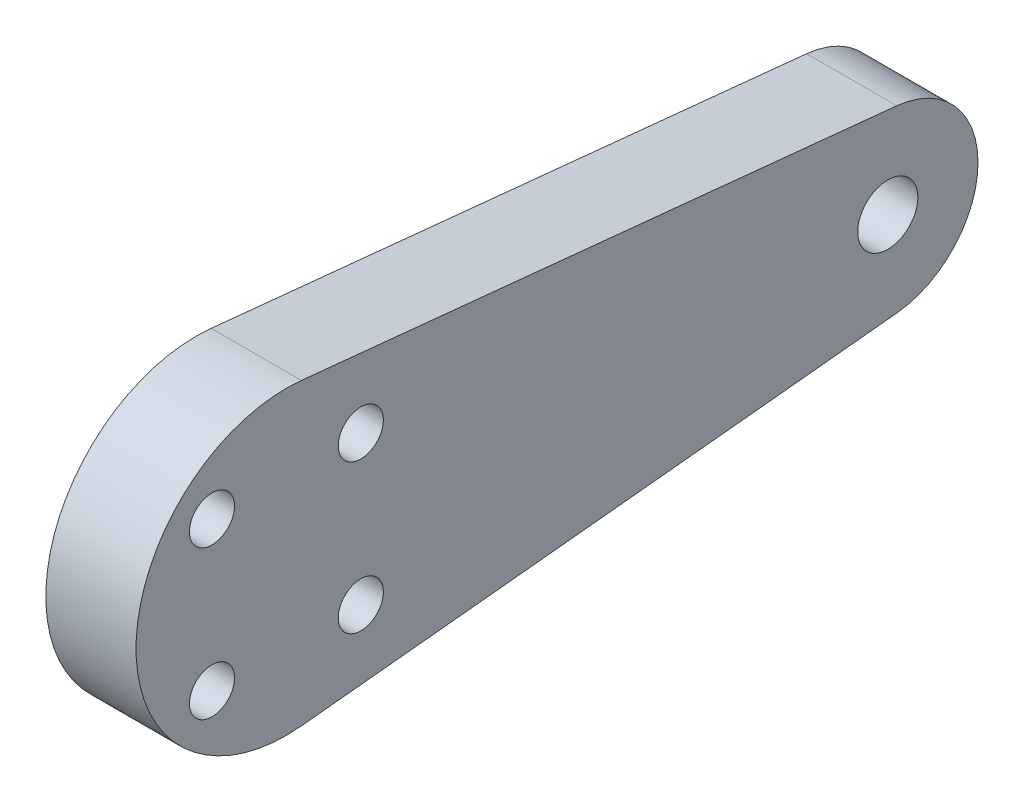
ISO-10303-21;
HEADER;
FILE_DESCRIPTION(('STEP AP214'),'2;1');
FILE_NAME('part.step','',(''),(''),'','','');
FILE_SCHEMA(('AUTOMOTIVE_DESIGN { 1 0 10303 214 1 1 1 1 }'));
ENDSEC;
DATA;
#1=APPLICATION_CONTEXT('core data for automotive mechanical design processes');
#2=APPLICATION_PROTOCOL_DEFINITION('international standard','automotive_design',2000,#1);
#3=PRODUCT_CONTEXT('',#1,'mechanical');
#4=PRODUCT('Part','Part','',(#3));
#5=PRODUCT_RELATED_PRODUCT_CATEGORY('part','',(#4));
#6=PRODUCT_DEFINITION_FORMATION('','',#4);
#7=PRODUCT_DEFINITION_CONTEXT('part definition',#1,'design');
#8=PRODUCT_DEFINITION('design','',#6,#7);
#9=PRODUCT_DEFINITION_SHAPE('','',#8);
#10=(LENGTH_UNIT() NAMED_UNIT(*) SI_UNIT(.MILLI.,.METRE.));
#11=(NAMED_UNIT(*) PLANE_ANGLE_UNIT() SI_UNIT($,.RADIAN.));
#12=(NAMED_UNIT(*) SI_UNIT($,.STERADIAN.) SOLID_ANGLE_UNIT());
#13=UNCERTAINTY_MEASURE_WITH_UNIT(LENGTH_MEASURE(1.E-05),#10,'distance_accuracy_value','');
#14=(GEOMETRIC_REPRESENTATION_CONTEXT(3) GLOBAL_UNCERTAINTY_ASSIGNED_CONTEXT((#13)) GLOBAL_UNIT_ASSIGNED_CONTEXT((#10,
#11,#12)) REPRESENTATION_CONTEXT('',''));
#15=CARTESIAN_POINT('',(0.,0.,0.));
#16=DIRECTION('',(0.,0.,1.));
#17=DIRECTION('',(1.,0.,0.));
#18=AXIS2_PLACEMENT_3D('',#15,#16,#17);
#19=CARTESIAN_POINT('',(3.,0.,0.));
#20=DIRECTION('',(-1.,0.,0.));
#21=DIRECTION('',(0.,0.,1.));
#22=AXIS2_PLACEMENT_3D('',#19,#20,#21);
#23=CYLINDRICAL_SURFACE('',#22,10.0000000000071);
#24=CARTESIAN_POINT('',(-3.,0.,0.));
#25=DIRECTION('',(1.,0.,0.));
#26=DIRECTION('',(0.,0.,-1.));
#27=AXIS2_PLACEMENT_3D('',#24,#25,#26);
#28=CIRCLE('',#27,10.0000000000071);
#29=CARTESIAN_POINT('',(-3.,9.94987437104468,-1.00000000001391));
#30=VERTEX_POINT('',#29);
#31=CARTESIAN_POINT('',(-3.,-9.94987437109485,-0.99999999998613));
#32=VERTEX_POINT('',#31);
#33=EDGE_CURVE('E107',#30,#32,#28,.T.);
#34=ORIENTED_EDGE('',*,*,#33,.T.);
#35=DIRECTION('',(-1.,0.,0.));
#36=VECTOR('',#35,1.);
#37=CARTESIAN_POINT('',(3.,-9.94987437109485,-0.99999999998613));
#38=LINE('',#37,#36);
#39=CARTESIAN_POINT('',(3.,-9.94987437109485,-0.99999999998613));
#40=VERTEX_POINT('',#39);
#41=EDGE_CURVE('E11',#40,#32,#38,.T.);
#42=ORIENTED_EDGE('',*,*,#41,.F.);
#43=CARTESIAN_POINT('',(3.,0.,0.));
#44=DIRECTION('',(1.,0.,0.));
#45=DIRECTION('',(0.,0.,-1.));
#46=AXIS2_PLACEMENT_3D('',#43,#44,#45);
#47=CIRCLE('',#46,10.0000000000071);
#48=CARTESIAN_POINT('',(3.,9.94987437104468,-1.00000000001391));
#49=VERTEX_POINT('',#48);
#50=EDGE_CURVE('E85',#49,#40,#47,.T.);
#51=ORIENTED_EDGE('',*,*,#50,.F.);
#52=DIRECTION('',(-1.,0.,0.));
#53=VECTOR('',#52,1.);
#54=CARTESIAN_POINT('',(3.,9.94987437104468,-1.00000000001391));
#55=LINE('',#54,#53);
#56=EDGE_CURVE('E106',#49,#30,#55,.T.);
#57=ORIENTED_EDGE('',*,*,#56,.T.);
#58=EDGE_LOOP('',(#34,#42,#51,#57));
#59=FACE_BOUND('',#58,.T.);
#60=ADVANCED_FACE('F43',(#59),#23,.T.);
#61=CARTESIAN_POINT('',(3.,-9.94987437111431,-0.999999999992834));
#62=DIRECTION('',(0.,-0.994987437106739,-0.0999999999988119));
#63=DIRECTION('',(0.,0.0999999999988119,-0.99498743710674));
#64=AXIS2_PLACEMENT_3D('',#61,#62,#63);
#65=PLANE('',#64);
#66=DIRECTION('',(0.,-0.0999999999988119,0.99498743710674));
#67=VECTOR('',#66,1.);
#68=CARTESIAN_POINT('',(-3.,-9.94987437111431,-0.999999999992834));
#69=LINE('',#68,#67);
#70=CARTESIAN_POINT('',(-3.,-5.96992462274733,-40.6000000000081));
#71=VERTEX_POINT('',#70);
#72=EDGE_CURVE('E95',#71,#32,#69,.T.);
#73=ORIENTED_EDGE('',*,*,#72,.F.);
#74=DIRECTION('',(-1.,0.,0.));
#75=VECTOR('',#74,1.);
#76=CARTESIAN_POINT('',(3.,-5.96992462274733,-40.6000000000081));
#77=LINE('',#76,#75);
#78=CARTESIAN_POINT('',(3.,-5.96992462274733,-40.6000000000081));
#79=VERTEX_POINT('',#78);
#80=EDGE_CURVE('E51',#79,#71,#77,.T.);
#81=ORIENTED_EDGE('',*,*,#80,.F.);
#82=DIRECTION('',(0.,-0.0999999999988119,0.99498743710674));
#83=VECTOR('',#82,1.);
#84=CARTESIAN_POINT('',(3.,-9.94987437111431,-0.999999999992834));
#85=LINE('',#84,#83);
#86=EDGE_CURVE('E93',#79,#40,#85,.T.);
#87=ORIENTED_EDGE('',*,*,#86,.T.);
#88=ORIENTED_EDGE('',*,*,#41,.T.);
#89=EDGE_LOOP('',(#73,#81,#87,#88));
#90=FACE_BOUND('',#89,.T.);
#91=ADVANCED_FACE('F92',(#90),#65,.T.);
#92=CARTESIAN_POINT('',(3.,-9.37531303060534E-11,-40.0000000000139));
#93=DIRECTION('',(-1.,0.,0.));
#94=DIRECTION('',(0.,0.,1.));
#95=AXIS2_PLACEMENT_3D('',#92,#93,#94);
#96=CYLINDRICAL_SURFACE('',#95,6.00000000002642);
#97=CARTESIAN_POINT('',(-3.,-9.37531303060534E-11,-40.0000000000139));
#98=DIRECTION('',(1.,0.,0.));
#99=DIRECTION('',(0.,0.,-1.));
#100=AXIS2_PLACEMENT_3D('',#97,#98,#99);
#101=CIRCLE('',#100,6.00000000002642);
#102=CARTESIAN_POINT('',(-3.,5.96992462255844,-40.6000000000219));
#103=VERTEX_POINT('',#102);
#104=EDGE_CURVE('E74',#71,#103,#101,.T.);
#105=ORIENTED_EDGE('',*,*,#104,.T.);
#106=DIRECTION('',(-1.,0.,0.));
#107=VECTOR('',#106,1.);
#108=CARTESIAN_POINT('',(3.,5.96992462255844,-40.6000000000219));
#109=LINE('',#108,#107);
#110=CARTESIAN_POINT('',(3.,5.96992462255844,-40.6000000000219));
#111=VERTEX_POINT('',#110);
#112=EDGE_CURVE('E96',#111,#103,#109,.T.);
#113=ORIENTED_EDGE('',*,*,#112,.F.);
#114=CARTESIAN_POINT('',(3.,-9.37531303060534E-11,-40.0000000000139));
#115=DIRECTION('',(1.,0.,0.));
#116=DIRECTION('',(0.,0.,-1.));
#117=AXIS2_PLACEMENT_3D('',#114,#115,#116);
#118=CIRCLE('',#117,6.00000000002642);
#119=EDGE_CURVE('E97',#79,#111,#118,.T.);
#120=ORIENTED_EDGE('',*,*,#119,.F.);
#121=ORIENTED_EDGE('',*,*,#80,.T.);
#122=EDGE_LOOP('',(#105,#113,#120,#121));
#123=FACE_BOUND('',#122,.T.);
#124=ADVANCED_FACE('F98',(#123),#96,.T.);
#125=CARTESIAN_POINT('',(3.,9.94987437101817,-1.00000000000647));
#126=DIRECTION('',(0.,-0.994987437106507,0.100000000001119));
#127=DIRECTION('',(0.,-0.100000000001119,-0.994987437106508));
#128=AXIS2_PLACEMENT_3D('',#125,#126,#127);
#129=PLANE('',#128);
#130=DIRECTION('',(0.,0.100000000001119,0.994987437106508));
#131=VECTOR('',#130,1.);
#132=CARTESIAN_POINT('',(-3.,9.94987437101817,-1.00000000000647));
#133=LINE('',#132,#131);
#134=EDGE_CURVE('E80',#103,#30,#133,.T.);
#135=ORIENTED_EDGE('',*,*,#134,.T.);
#136=ORIENTED_EDGE('',*,*,#56,.F.);
#137=DIRECTION('',(0.,0.100000000001119,0.994987437106508));
#138=VECTOR('',#137,1.);
#139=CARTESIAN_POINT('',(3.,9.94987437101817,-1.00000000000647));
#140=LINE('',#139,#138);
#141=EDGE_CURVE('E59',#111,#49,#140,.T.);
#142=ORIENTED_EDGE('',*,*,#141,.F.);
#143=ORIENTED_EDGE('',*,*,#112,.T.);
#144=EDGE_LOOP('',(#135,#136,#142,#143));
#145=FACE_BOUND('',#144,.T.);
#146=ADVANCED_FACE('F115',(#145),#129,.F.);
#147=CARTESIAN_POINT('',(3.,0.,0.));
#148=DIRECTION('',(1.,0.,0.));
#149=DIRECTION('',(0.,0.,-1.));
#150=AXIS2_PLACEMENT_3D('',#147,#148,#149);
#151=PLANE('',#150);
#152=CARTESIAN_POINT('',(3.,-9.37531302591665E-11,-40.0000000000139));
#153=DIRECTION('',(1.,0.,0.));
#154=DIRECTION('',(0.,0.,-1.));
#155=AXIS2_PLACEMENT_3D('',#152,#153,#154);
#156=CIRCLE('',#155,2.);
#157=CARTESIAN_POINT('',(3.,-9.37531302591665E-11,-42.0000000000139));
#158=VERTEX_POINT('',#157);
#159=EDGE_CURVE('E164',#158,#158,#156,.T.);
#160=ORIENTED_EDGE('',*,*,#159,.F.);
#161=EDGE_LOOP('',(#160));
#162=FACE_BOUND('',#161,.T.);
#163=CARTESIAN_POINT('',(3.,4.94974746825873,4.94974746830554));
#164=DIRECTION('',(1.,0.,0.));
#165=DIRECTION('',(0.,0.,-1.));
#166=AXIS2_PLACEMENT_3D('',#163,#164,#165);
#167=CIRCLE('',#166,1.50000000001431);
#168=CARTESIAN_POINT('',(3.,4.94974746825873,3.44974746829123));
#169=VERTEX_POINT('',#168);
#170=EDGE_CURVE('E180',#169,#169,#167,.T.);
#171=ORIENTED_EDGE('',*,*,#170,.F.);
#172=EDGE_LOOP('',(#171));
#173=FACE_BOUND('',#172,.T.);
#174=CARTESIAN_POINT('',(3.,-4.94974746835294,4.94974746830582));
#175=DIRECTION('',(1.,0.,0.));
#176=DIRECTION('',(0.,0.,-1.));
#177=AXIS2_PLACEMENT_3D('',#174,#175,#176);
#178=CIRCLE('',#177,1.50000000001421);
#179=CARTESIAN_POINT('',(3.,-4.94974746835294,3.44974746829161));
#180=VERTEX_POINT('',#179);
#181=EDGE_CURVE('E173',#180,#180,#178,.T.);
#182=ORIENTED_EDGE('',*,*,#181,.F.);
#183=EDGE_LOOP('',(#182));
#184=FACE_BOUND('',#183,.T.);
#185=CARTESIAN_POINT('',(3.,-4.94974746835322,-4.94974746830585));
#186=DIRECTION('',(1.,0.,0.));
#187=DIRECTION('',(0.,0.,-1.));
#188=AXIS2_PLACEMENT_3D('',#185,#186,#187);
#189=CIRCLE('',#188,1.5000000000139);
#190=CARTESIAN_POINT('',(3.,-4.94974746835322,-6.44974746831974));
#191=VERTEX_POINT('',#190);
#192=EDGE_CURVE('E172',#191,#191,#189,.T.);
#193=ORIENTED_EDGE('',*,*,#192,.F.);
#194=EDGE_LOOP('',(#193));
#195=FACE_BOUND('',#194,.T.);
#196=CARTESIAN_POINT('',(3.,4.94974746825845,-4.94974746830613));
#197=DIRECTION('',(1.,0.,0.));
#198=DIRECTION('',(0.,0.,-1.));
#199=AXIS2_PLACEMENT_3D('',#196,#197,#198);
#200=CIRCLE('',#199,1.50000000001406);
#201=CARTESIAN_POINT('',(3.,4.94974746825845,-6.44974746832019));
#202=VERTEX_POINT('',#201);
#203=EDGE_CURVE('E176',#202,#202,#200,.T.);
#204=ORIENTED_EDGE('',*,*,#203,.F.);
#205=EDGE_LOOP('',(#204));
#206=FACE_BOUND('',#205,.T.);
#207=ORIENTED_EDGE('',*,*,#50,.T.);
#208=ORIENTED_EDGE('',*,*,#86,.F.);
#209=ORIENTED_EDGE('',*,*,#119,.T.);
#210=ORIENTED_EDGE('',*,*,#141,.T.);
#211=EDGE_LOOP('',(#207,#208,#209,#210));
#212=FACE_BOUND('',#211,.T.);
#213=ADVANCED_FACE('F100',(#162,#173,#184,#195,#206,#212),#151,.T.);
#214=CARTESIAN_POINT('',(-3.,0.,0.));
#215=DIRECTION('',(1.,0.,0.));
#216=DIRECTION('',(0.,0.,-1.));
#217=AXIS2_PLACEMENT_3D('',#214,#215,#216);
#218=PLANE('',#217);
#219=CARTESIAN_POINT('',(-3.,-9.37531302591665E-11,-40.0000000000139));
#220=DIRECTION('',(1.,0.,0.));
#221=DIRECTION('',(0.,0.,-1.));
#222=AXIS2_PLACEMENT_3D('',#219,#220,#221);
#223=CIRCLE('',#222,2.);
#224=CARTESIAN_POINT('',(-3.,-9.37531302591665E-11,-42.0000000000139));
#225=VERTEX_POINT('',#224);
#226=EDGE_CURVE('E161',#225,#225,#223,.T.);
#227=ORIENTED_EDGE('',*,*,#226,.T.);
#228=EDGE_LOOP('',(#227));
#229=FACE_BOUND('',#228,.T.);
#230=CARTESIAN_POINT('',(-3.,4.94974746825873,4.94974746830554));
#231=DIRECTION('',(1.,0.,0.));
#232=DIRECTION('',(0.,0.,-1.));
#233=AXIS2_PLACEMENT_3D('',#230,#231,#232);
#234=CIRCLE('',#233,1.50000000001431);
#235=CARTESIAN_POINT('',(-3.,4.94974746825873,3.44974746829123));
#236=VERTEX_POINT('',#235);
#237=EDGE_CURVE('E166',#236,#236,#234,.T.);
#238=ORIENTED_EDGE('',*,*,#237,.T.);
#239=EDGE_LOOP('',(#238));
#240=FACE_BOUND('',#239,.T.);
#241=CARTESIAN_POINT('',(-3.,-4.94974746835294,4.94974746830582));
#242=DIRECTION('',(1.,0.,0.));
#243=DIRECTION('',(0.,0.,-1.));
#244=AXIS2_PLACEMENT_3D('',#241,#242,#243);
#245=CIRCLE('',#244,1.50000000001421);
#246=CARTESIAN_POINT('',(-3.,-4.94974746835294,3.44974746829161));
#247=VERTEX_POINT('',#246);
#248=EDGE_CURVE('E177',#247,#247,#245,.T.);
#249=ORIENTED_EDGE('',*,*,#248,.T.);
#250=EDGE_LOOP('',(#249));
#251=FACE_BOUND('',#250,.T.);
#252=CARTESIAN_POINT('',(-3.,-4.94974746835322,-4.94974746830585));
#253=DIRECTION('',(1.,0.,0.));
#254=DIRECTION('',(0.,0.,-1.));
#255=AXIS2_PLACEMENT_3D('',#252,#253,#254);
#256=CIRCLE('',#255,1.5000000000139);
#257=CARTESIAN_POINT('',(-3.,-4.94974746835322,-6.44974746831974));
#258=VERTEX_POINT('',#257);
#259=EDGE_CURVE('E169',#258,#258,#256,.T.);
#260=ORIENTED_EDGE('',*,*,#259,.T.);
#261=EDGE_LOOP('',(#260));
#262=FACE_BOUND('',#261,.T.);
#263=CARTESIAN_POINT('',(-3.,4.94974746825845,-4.94974746830613));
#264=DIRECTION('',(1.,0.,0.));
#265=DIRECTION('',(0.,0.,-1.));
#266=AXIS2_PLACEMENT_3D('',#263,#264,#265);
#267=CIRCLE('',#266,1.50000000001406);
#268=CARTESIAN_POINT('',(-3.,4.94974746825845,-6.44974746832019));
#269=VERTEX_POINT('',#268);
#270=EDGE_CURVE('E110',#269,#269,#267,.T.);
#271=ORIENTED_EDGE('',*,*,#270,.T.);
#272=EDGE_LOOP('',(#271));
#273=FACE_BOUND('',#272,.T.);
#274=ORIENTED_EDGE('',*,*,#33,.F.);
#275=ORIENTED_EDGE('',*,*,#134,.F.);
#276=ORIENTED_EDGE('',*,*,#104,.F.);
#277=ORIENTED_EDGE('',*,*,#72,.T.);
#278=EDGE_LOOP('',(#274,#275,#276,#277));
#279=FACE_BOUND('',#278,.T.);
#280=ADVANCED_FACE('F118',(#229,#240,#251,#262,#273,#279),#218,.F.);
#281=CARTESIAN_POINT('',(-3.,4.94974746825845,-4.94974746830613));
#282=DIRECTION('',(1.,0.,0.));
#283=DIRECTION('',(0.,0.,-1.));
#284=AXIS2_PLACEMENT_3D('',#281,#282,#283);
#285=CYLINDRICAL_SURFACE('',#284,1.50000000001406);
#286=ORIENTED_EDGE('',*,*,#270,.F.);
#287=EDGE_LOOP('',(#286));
#288=FACE_BOUND('',#287,.T.);
#289=ORIENTED_EDGE('',*,*,#203,.T.);
#290=EDGE_LOOP('',(#289));
#291=FACE_BOUND('',#290,.T.);
#292=ADVANCED_FACE('F133',(#288,#291),#285,.F.);
#293=CARTESIAN_POINT('',(-3.,-4.94974746835322,-4.94974746830585));
#294=DIRECTION('',(1.,0.,0.));
#295=DIRECTION('',(0.,0.,-1.));
#296=AXIS2_PLACEMENT_3D('',#293,#294,#295);
#297=CYLINDRICAL_SURFACE('',#296,1.5000000000139);
#298=ORIENTED_EDGE('',*,*,#259,.F.);
#299=EDGE_LOOP('',(#298));
#300=FACE_BOUND('',#299,.T.);
#301=ORIENTED_EDGE('',*,*,#192,.T.);
#302=EDGE_LOOP('',(#301));
#303=FACE_BOUND('',#302,.T.);
#304=ADVANCED_FACE('F140',(#300,#303),#297,.F.);
#305=CARTESIAN_POINT('',(-3.,-4.94974746835294,4.94974746830582));
#306=DIRECTION('',(1.,0.,0.));
#307=DIRECTION('',(0.,0.,-1.));
#308=AXIS2_PLACEMENT_3D('',#305,#306,#307);
#309=CYLINDRICAL_SURFACE('',#308,1.50000000001421);
#310=ORIENTED_EDGE('',*,*,#248,.F.);
#311=EDGE_LOOP('',(#310));
#312=FACE_BOUND('',#311,.T.);
#313=ORIENTED_EDGE('',*,*,#181,.T.);
#314=EDGE_LOOP('',(#313));
#315=FACE_BOUND('',#314,.T.);
#316=ADVANCED_FACE('F146',(#312,#315),#309,.F.);
#317=CARTESIAN_POINT('',(-3.,4.94974746825873,4.94974746830554));
#318=DIRECTION('',(1.,0.,0.));
#319=DIRECTION('',(0.,0.,-1.));
#320=AXIS2_PLACEMENT_3D('',#317,#318,#319);
#321=CYLINDRICAL_SURFACE('',#320,1.50000000001431);
#322=ORIENTED_EDGE('',*,*,#237,.F.);
#323=EDGE_LOOP('',(#322));
#324=FACE_BOUND('',#323,.T.);
#325=ORIENTED_EDGE('',*,*,#170,.T.);
#326=EDGE_LOOP('',(#325));
#327=FACE_BOUND('',#326,.T.);
#328=ADVANCED_FACE('F142',(#324,#327),#321,.F.);
#329=CARTESIAN_POINT('',(3.,-9.37531302591665E-11,-40.0000000000139));
#330=DIRECTION('',(1.,0.,0.));
#331=DIRECTION('',(0.,0.,-1.));
#332=AXIS2_PLACEMENT_3D('',#329,#330,#331);
#333=CYLINDRICAL_SURFACE('',#332,2.);
#334=ORIENTED_EDGE('',*,*,#226,.F.);
#335=EDGE_LOOP('',(#334));
#336=FACE_BOUND('',#335,.T.);
#337=ORIENTED_EDGE('',*,*,#159,.T.);
#338=EDGE_LOOP('',(#337));
#339=FACE_BOUND('',#338,.T.);
#340=ADVANCED_FACE('F145',(#336,#339),#333,.F.);
#341=CLOSED_SHELL('',(#60,#91,#124,#146,#213,#280,#292,#304,#316,#328,#340));
#342=MANIFOLD_SOLID_BREP('B2',#341);
#343=ADVANCED_BREP_SHAPE_REPRESENTATION('',(#18,#342),#14);
#344=SHAPE_DEFINITION_REPRESENTATION(#9,#343);
ENDSEC;
END-ISO-10303-21;
